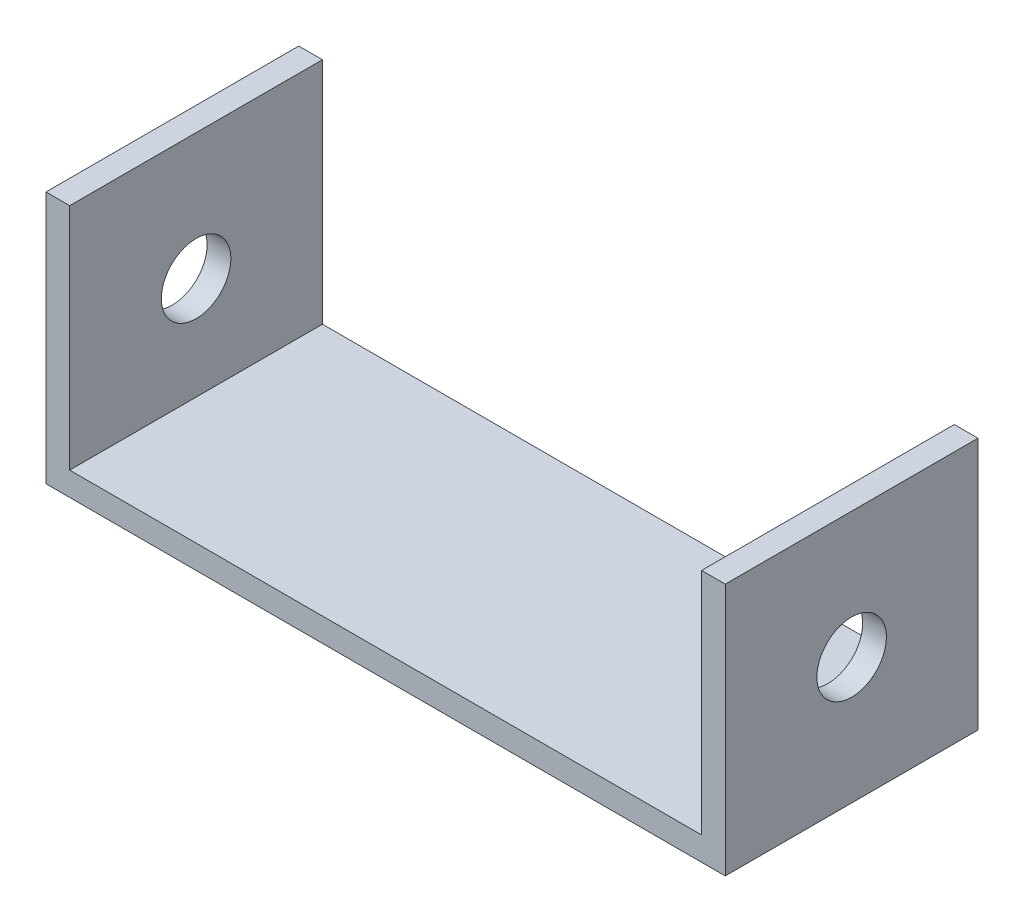
ISO-10303-21;
HEADER;
FILE_DESCRIPTION(('STEP AP214'),'2;1');
FILE_NAME('part.step','',(''),(''),'','','');
FILE_SCHEMA(('AUTOMOTIVE_DESIGN { 1 0 10303 214 1 1 1 1 }'));
ENDSEC;
DATA;
#1=APPLICATION_CONTEXT('core data for automotive mechanical design processes');
#2=APPLICATION_PROTOCOL_DEFINITION('international standard','automotive_design',2000,#1);
#3=PRODUCT_CONTEXT('',#1,'mechanical');
#4=PRODUCT('Part','Part','',(#3));
#5=PRODUCT_RELATED_PRODUCT_CATEGORY('part','',(#4));
#6=PRODUCT_DEFINITION_FORMATION('','',#4);
#7=PRODUCT_DEFINITION_CONTEXT('part definition',#1,'design');
#8=PRODUCT_DEFINITION('design','',#6,#7);
#9=PRODUCT_DEFINITION_SHAPE('','',#8);
#10=(LENGTH_UNIT() NAMED_UNIT(*) SI_UNIT(.MILLI.,.METRE.));
#11=(NAMED_UNIT(*) PLANE_ANGLE_UNIT() SI_UNIT($,.RADIAN.));
#12=(NAMED_UNIT(*) SI_UNIT($,.STERADIAN.) SOLID_ANGLE_UNIT());
#13=UNCERTAINTY_MEASURE_WITH_UNIT(LENGTH_MEASURE(1.E-05),#10,'distance_accuracy_value','');
#14=(GEOMETRIC_REPRESENTATION_CONTEXT(3) GLOBAL_UNCERTAINTY_ASSIGNED_CONTEXT((#13)) GLOBAL_UNIT_ASSIGNED_CONTEXT((#10,
#11,#12)) REPRESENTATION_CONTEXT('',''));
#15=CARTESIAN_POINT('',(0.,0.,0.));
#16=DIRECTION('',(0.,0.,1.));
#17=DIRECTION('',(1.,0.,0.));
#18=AXIS2_PLACEMENT_3D('',#15,#16,#17);
#19=CARTESIAN_POINT('',(-70.1343283582089,4.7625,19.334328358209));
#20=DIRECTION('',(0.,0.,-1.));
#21=DIRECTION('',(-1.,0.,0.));
#22=AXIS2_PLACEMENT_3D('',#19,#20,#21);
#23=PLANE('',#22);
#24=DIRECTION('',(1.,0.,0.));
#25=VECTOR('',#24,1.);
#26=CARTESIAN_POINT('',(-70.1343283582089,0.,19.334328358209));
#27=LINE('',#26,#25);
#28=CARTESIAN_POINT('',(-74.8968283582089,0.,19.334328358209));
#29=VERTEX_POINT('',#28);
#30=CARTESIAN_POINT('',(61.6281716417911,0.,19.334328358209));
#31=VERTEX_POINT('',#30);
#32=EDGE_CURVE('E296',#29,#31,#27,.T.);
#33=ORIENTED_EDGE('',*,*,#32,.T.);
#34=DIRECTION('',(0.,-1.,0.));
#35=VECTOR('',#34,1.);
#36=CARTESIAN_POINT('',(61.6281716417911,50.8,19.334328358209));
#37=LINE('',#36,#35);
#38=CARTESIAN_POINT('',(61.6281716417911,50.8,19.334328358209));
#39=VERTEX_POINT('',#38);
#40=EDGE_CURVE('E307',#39,#31,#37,.T.);
#41=ORIENTED_EDGE('',*,*,#40,.F.);
#42=DIRECTION('',(1.,0.,0.));
#43=VECTOR('',#42,1.);
#44=CARTESIAN_POINT('',(61.6281716417911,50.8,19.334328358209));
#45=LINE('',#44,#43);
#46=CARTESIAN_POINT('',(56.8656716417911,50.8,19.334328358209));
#47=VERTEX_POINT('',#46);
#48=EDGE_CURVE('E289',#47,#39,#45,.T.);
#49=ORIENTED_EDGE('',*,*,#48,.F.);
#50=DIRECTION('',(0.,-1.,0.));
#51=VECTOR('',#50,1.);
#52=CARTESIAN_POINT('',(56.8656716417911,50.8,19.334328358209));
#53=LINE('',#52,#51);
#54=CARTESIAN_POINT('',(56.8656716417911,4.7625,19.334328358209));
#55=VERTEX_POINT('',#54);
#56=EDGE_CURVE('E300',#47,#55,#53,.T.);
#57=ORIENTED_EDGE('',*,*,#56,.T.);
#58=DIRECTION('',(1.,0.,0.));
#59=VECTOR('',#58,1.);
#60=CARTESIAN_POINT('',(-70.1343283582089,4.7625,19.334328358209));
#61=LINE('',#60,#59);
#62=CARTESIAN_POINT('',(-70.1343283582089,4.7625,19.334328358209));
#63=VERTEX_POINT('',#62);
#64=EDGE_CURVE('E320',#63,#55,#61,.T.);
#65=ORIENTED_EDGE('',*,*,#64,.F.);
#66=DIRECTION('',(0.,-1.,0.));
#67=VECTOR('',#66,1.);
#68=CARTESIAN_POINT('',(-70.1343283582089,50.8,19.334328358209));
#69=LINE('',#68,#67);
#70=CARTESIAN_POINT('',(-70.1343283582089,50.8,19.334328358209));
#71=VERTEX_POINT('',#70);
#72=EDGE_CURVE('E58',#71,#63,#69,.T.);
#73=ORIENTED_EDGE('',*,*,#72,.F.);
#74=DIRECTION('',(1.,0.,0.));
#75=VECTOR('',#74,1.);
#76=CARTESIAN_POINT('',(-74.8968283582089,50.8,19.334328358209));
#77=LINE('',#76,#75);
#78=CARTESIAN_POINT('',(-74.8968283582089,50.8,19.334328358209));
#79=VERTEX_POINT('',#78);
#80=EDGE_CURVE('E101',#79,#71,#77,.T.);
#81=ORIENTED_EDGE('',*,*,#80,.F.);
#82=DIRECTION('',(0.,-1.,0.));
#83=VECTOR('',#82,1.);
#84=CARTESIAN_POINT('',(-74.8968283582089,50.8,19.334328358209));
#85=LINE('',#84,#83);
#86=EDGE_CURVE('E104',#79,#29,#85,.T.);
#87=ORIENTED_EDGE('',*,*,#86,.T.);
#88=EDGE_LOOP('',(#33,#41,#49,#57,#65,#73,#81,#87));
#89=FACE_BOUND('',#88,.T.);
#90=ADVANCED_FACE('F34',(#89),#23,.F.);
#91=CARTESIAN_POINT('',(-70.1343283582089,4.7625,-31.465671641791));
#92=DIRECTION('',(0.,0.,1.));
#93=DIRECTION('',(1.,0.,0.));
#94=AXIS2_PLACEMENT_3D('',#91,#92,#93);
#95=PLANE('',#94);
#96=DIRECTION('',(-1.,0.,0.));
#97=VECTOR('',#96,1.);
#98=CARTESIAN_POINT('',(-70.1343283582089,0.,-31.465671641791));
#99=LINE('',#98,#97);
#100=CARTESIAN_POINT('',(61.6281716417911,0.,-31.465671641791));
#101=VERTEX_POINT('',#100);
#102=CARTESIAN_POINT('',(-74.8968283582089,0.,-31.465671641791));
#103=VERTEX_POINT('',#102);
#104=EDGE_CURVE('E298',#101,#103,#99,.T.);
#105=ORIENTED_EDGE('',*,*,#104,.T.);
#106=DIRECTION('',(0.,-1.,0.));
#107=VECTOR('',#106,1.);
#108=CARTESIAN_POINT('',(-74.8968283582089,50.8,-31.465671641791));
#109=LINE('',#108,#107);
#110=CARTESIAN_POINT('',(-74.8968283582089,50.8,-31.465671641791));
#111=VERTEX_POINT('',#110);
#112=EDGE_CURVE('E133',#111,#103,#109,.T.);
#113=ORIENTED_EDGE('',*,*,#112,.F.);
#114=DIRECTION('',(-1.,0.,0.));
#115=VECTOR('',#114,1.);
#116=CARTESIAN_POINT('',(-74.8968283582089,50.8,-31.465671641791));
#117=LINE('',#116,#115);
#118=CARTESIAN_POINT('',(-70.1343283582089,50.8,-31.465671641791));
#119=VERTEX_POINT('',#118);
#120=EDGE_CURVE('E113',#119,#111,#117,.T.);
#121=ORIENTED_EDGE('',*,*,#120,.F.);
#122=DIRECTION('',(0.,-1.,0.));
#123=VECTOR('',#122,1.);
#124=CARTESIAN_POINT('',(-70.1343283582089,50.8,-31.465671641791));
#125=LINE('',#124,#123);
#126=CARTESIAN_POINT('',(-70.1343283582089,4.7625,-31.465671641791));
#127=VERTEX_POINT('',#126);
#128=EDGE_CURVE('E126',#119,#127,#125,.T.);
#129=ORIENTED_EDGE('',*,*,#128,.T.);
#130=DIRECTION('',(-1.,0.,0.));
#131=VECTOR('',#130,1.);
#132=CARTESIAN_POINT('',(-70.1343283582089,4.7625,-31.465671641791));
#133=LINE('',#132,#131);
#134=CARTESIAN_POINT('',(56.8656716417911,4.7625,-31.465671641791));
#135=VERTEX_POINT('',#134);
#136=EDGE_CURVE('E11',#135,#127,#133,.T.);
#137=ORIENTED_EDGE('',*,*,#136,.F.);
#138=DIRECTION('',(0.,-1.,0.));
#139=VECTOR('',#138,1.);
#140=CARTESIAN_POINT('',(56.8656716417911,50.8,-31.465671641791));
#141=LINE('',#140,#139);
#142=CARTESIAN_POINT('',(56.8656716417911,50.8,-31.465671641791));
#143=VERTEX_POINT('',#142);
#144=EDGE_CURVE('E50',#143,#135,#141,.T.);
#145=ORIENTED_EDGE('',*,*,#144,.F.);
#146=DIRECTION('',(-1.,0.,0.));
#147=VECTOR('',#146,1.);
#148=CARTESIAN_POINT('',(61.6281716417911,50.8,-31.465671641791));
#149=LINE('',#148,#147);
#150=CARTESIAN_POINT('',(61.6281716417911,50.8,-31.465671641791));
#151=VERTEX_POINT('',#150);
#152=EDGE_CURVE('E287',#151,#143,#149,.T.);
#153=ORIENTED_EDGE('',*,*,#152,.F.);
#154=DIRECTION('',(0.,-1.,0.));
#155=VECTOR('',#154,1.);
#156=CARTESIAN_POINT('',(61.6281716417911,50.8,-31.465671641791));
#157=LINE('',#156,#155);
#158=EDGE_CURVE('E294',#151,#101,#157,.T.);
#159=ORIENTED_EDGE('',*,*,#158,.T.);
#160=EDGE_LOOP('',(#105,#113,#121,#129,#137,#145,#153,#159));
#161=FACE_BOUND('',#160,.T.);
#162=ADVANCED_FACE('F168',(#161),#95,.F.);
#163=CARTESIAN_POINT('',(0.,4.7625,0.));
#164=DIRECTION('',(0.,1.,0.));
#165=DIRECTION('',(0.,0.,1.));
#166=AXIS2_PLACEMENT_3D('',#163,#164,#165);
#167=PLANE('',#166);
#168=DIRECTION('',(0.,0.,1.));
#169=VECTOR('',#168,1.);
#170=CARTESIAN_POINT('',(-70.1343283582089,4.7625,-31.465671641791));
#171=LINE('',#170,#169);
#172=EDGE_CURVE('E317',#127,#63,#171,.T.);
#173=ORIENTED_EDGE('',*,*,#172,.T.);
#174=ORIENTED_EDGE('',*,*,#64,.T.);
#175=DIRECTION('',(0.,0.,-1.));
#176=VECTOR('',#175,1.);
#177=CARTESIAN_POINT('',(56.8656716417911,4.7625,-31.465671641791));
#178=LINE('',#177,#176);
#179=EDGE_CURVE('E42',#55,#135,#178,.T.);
#180=ORIENTED_EDGE('',*,*,#179,.T.);
#181=ORIENTED_EDGE('',*,*,#136,.T.);
#182=EDGE_LOOP('',(#173,#174,#180,#181));
#183=FACE_BOUND('',#182,.T.);
#184=ADVANCED_FACE('F172',(#183),#167,.T.);
#185=CARTESIAN_POINT('',(0.,0.,0.));
#186=DIRECTION('',(0.,1.,0.));
#187=DIRECTION('',(0.,0.,1.));
#188=AXIS2_PLACEMENT_3D('',#185,#186,#187);
#189=PLANE('',#188);
#190=ORIENTED_EDGE('',*,*,#32,.F.);
#191=DIRECTION('',(0.,0.,1.));
#192=VECTOR('',#191,1.);
#193=CARTESIAN_POINT('',(-74.8968283582089,0.,-31.465671641791));
#194=LINE('',#193,#192);
#195=EDGE_CURVE('E117',#103,#29,#194,.T.);
#196=ORIENTED_EDGE('',*,*,#195,.F.);
#197=ORIENTED_EDGE('',*,*,#104,.F.);
#198=DIRECTION('',(0.,0.,-1.));
#199=VECTOR('',#198,1.);
#200=CARTESIAN_POINT('',(61.6281716417911,0.,-31.465671641791));
#201=LINE('',#200,#199);
#202=EDGE_CURVE('E121',#31,#101,#201,.T.);
#203=ORIENTED_EDGE('',*,*,#202,.F.);
#204=EDGE_LOOP('',(#190,#196,#197,#203));
#205=FACE_BOUND('',#204,.T.);
#206=ADVANCED_FACE('F177',(#205),#189,.F.);
#207=CARTESIAN_POINT('',(61.6281716417911,50.8,-31.465671641791));
#208=DIRECTION('',(-1.,0.,0.));
#209=DIRECTION('',(0.,0.,1.));
#210=AXIS2_PLACEMENT_3D('',#207,#208,#209);
#211=PLANE('',#210);
#212=CARTESIAN_POINT('',(61.6281716417911,25.4,-6.06567164179102));
#213=DIRECTION('',(-1.,0.,0.));
#214=DIRECTION('',(0.,0.,1.));
#215=AXIS2_PLACEMENT_3D('',#212,#213,#214);
#216=CIRCLE('',#215,6.985);
#217=CARTESIAN_POINT('',(61.6281716417911,25.4,0.919328358208984));
#218=VERTEX_POINT('',#217);
#219=EDGE_CURVE('E147',#218,#218,#216,.T.);
#220=ORIENTED_EDGE('',*,*,#219,.T.);
#221=EDGE_LOOP('',(#220));
#222=FACE_BOUND('',#221,.T.);
#223=ORIENTED_EDGE('',*,*,#202,.T.);
#224=ORIENTED_EDGE('',*,*,#158,.F.);
#225=DIRECTION('',(0.,0.,-1.));
#226=VECTOR('',#225,1.);
#227=CARTESIAN_POINT('',(61.6281716417911,50.8,-31.465671641791));
#228=LINE('',#227,#226);
#229=EDGE_CURVE('E124',#39,#151,#228,.T.);
#230=ORIENTED_EDGE('',*,*,#229,.F.);
#231=ORIENTED_EDGE('',*,*,#40,.T.);
#232=EDGE_LOOP('',(#223,#224,#230,#231));
#233=FACE_BOUND('',#232,.T.);
#234=ADVANCED_FACE('F182',(#222,#233),#211,.F.);
#235=CARTESIAN_POINT('',(56.8656716417911,50.8,-31.465671641791));
#236=DIRECTION('',(1.,0.,0.));
#237=DIRECTION('',(0.,0.,-1.));
#238=AXIS2_PLACEMENT_3D('',#235,#236,#237);
#239=PLANE('',#238);
#240=CARTESIAN_POINT('',(56.8656716417911,25.4,-6.06567164179102));
#241=DIRECTION('',(1.,0.,0.));
#242=DIRECTION('',(0.,0.,-1.));
#243=AXIS2_PLACEMENT_3D('',#240,#241,#242);
#244=CIRCLE('',#243,6.985);
#245=CARTESIAN_POINT('',(56.8656716417911,25.4,-13.050671641791));
#246=VERTEX_POINT('',#245);
#247=EDGE_CURVE('E139',#246,#246,#244,.T.);
#248=ORIENTED_EDGE('',*,*,#247,.T.);
#249=EDGE_LOOP('',(#248));
#250=FACE_BOUND('',#249,.T.);
#251=ORIENTED_EDGE('',*,*,#179,.F.);
#252=ORIENTED_EDGE('',*,*,#56,.F.);
#253=DIRECTION('',(0.,0.,1.));
#254=VECTOR('',#253,1.);
#255=CARTESIAN_POINT('',(56.8656716417911,50.8,-31.465671641791));
#256=LINE('',#255,#254);
#257=EDGE_CURVE('E313',#143,#47,#256,.T.);
#258=ORIENTED_EDGE('',*,*,#257,.F.);
#259=ORIENTED_EDGE('',*,*,#144,.T.);
#260=EDGE_LOOP('',(#251,#252,#258,#259));
#261=FACE_BOUND('',#260,.T.);
#262=ADVANCED_FACE('F187',(#250,#261),#239,.F.);
#263=CARTESIAN_POINT('',(0.,50.8,0.));
#264=DIRECTION('',(0.,-1.,0.));
#265=DIRECTION('',(0.,0.,-1.));
#266=AXIS2_PLACEMENT_3D('',#263,#264,#265);
#267=PLANE('',#266);
#268=ORIENTED_EDGE('',*,*,#229,.T.);
#269=ORIENTED_EDGE('',*,*,#152,.T.);
#270=ORIENTED_EDGE('',*,*,#257,.T.);
#271=ORIENTED_EDGE('',*,*,#48,.T.);
#272=EDGE_LOOP('',(#268,#269,#270,#271));
#273=FACE_BOUND('',#272,.T.);
#274=ADVANCED_FACE('F190',(#273),#267,.F.);
#275=CARTESIAN_POINT('',(-74.8968283582089,50.8,-31.465671641791));
#276=DIRECTION('',(1.,0.,0.));
#277=DIRECTION('',(0.,0.,-1.));
#278=AXIS2_PLACEMENT_3D('',#275,#276,#277);
#279=PLANE('',#278);
#280=CARTESIAN_POINT('',(-74.8968283582089,25.4,-6.06567164179102));
#281=DIRECTION('',(-1.,0.,0.));
#282=DIRECTION('',(0.,0.,1.));
#283=AXIS2_PLACEMENT_3D('',#280,#281,#282);
#284=CIRCLE('',#283,6.985);
#285=CARTESIAN_POINT('',(-74.8968283582089,25.4,0.919328358208984));
#286=VERTEX_POINT('',#285);
#287=EDGE_CURVE('E144',#286,#286,#284,.T.);
#288=ORIENTED_EDGE('',*,*,#287,.F.);
#289=EDGE_LOOP('',(#288));
#290=FACE_BOUND('',#289,.T.);
#291=ORIENTED_EDGE('',*,*,#195,.T.);
#292=ORIENTED_EDGE('',*,*,#86,.F.);
#293=DIRECTION('',(0.,0.,1.));
#294=VECTOR('',#293,1.);
#295=CARTESIAN_POINT('',(-74.8968283582089,50.8,-31.465671641791));
#296=LINE('',#295,#294);
#297=EDGE_CURVE('E108',#111,#79,#296,.T.);
#298=ORIENTED_EDGE('',*,*,#297,.F.);
#299=ORIENTED_EDGE('',*,*,#112,.T.);
#300=EDGE_LOOP('',(#291,#292,#298,#299));
#301=FACE_BOUND('',#300,.T.);
#302=ADVANCED_FACE('F119',(#290,#301),#279,.F.);
#303=CARTESIAN_POINT('',(-70.1343283582089,50.8,-31.465671641791));
#304=DIRECTION('',(-1.,0.,0.));
#305=DIRECTION('',(0.,0.,1.));
#306=AXIS2_PLACEMENT_3D('',#303,#304,#305);
#307=PLANE('',#306);
#308=CARTESIAN_POINT('',(-70.1343283582089,25.4,-6.06567164179102));
#309=DIRECTION('',(-1.,0.,0.));
#310=DIRECTION('',(0.,0.,1.));
#311=AXIS2_PLACEMENT_3D('',#308,#309,#310);
#312=CIRCLE('',#311,6.985);
#313=CARTESIAN_POINT('',(-70.1343283582089,25.4,0.919328358208984));
#314=VERTEX_POINT('',#313);
#315=EDGE_CURVE('E37',#314,#314,#312,.T.);
#316=ORIENTED_EDGE('',*,*,#315,.T.);
#317=EDGE_LOOP('',(#316));
#318=FACE_BOUND('',#317,.T.);
#319=ORIENTED_EDGE('',*,*,#172,.F.);
#320=ORIENTED_EDGE('',*,*,#128,.F.);
#321=DIRECTION('',(0.,0.,-1.));
#322=VECTOR('',#321,1.);
#323=CARTESIAN_POINT('',(-70.1343283582089,50.8,-31.465671641791));
#324=LINE('',#323,#322);
#325=EDGE_CURVE('E107',#71,#119,#324,.T.);
#326=ORIENTED_EDGE('',*,*,#325,.F.);
#327=ORIENTED_EDGE('',*,*,#72,.T.);
#328=EDGE_LOOP('',(#319,#320,#326,#327));
#329=FACE_BOUND('',#328,.T.);
#330=ADVANCED_FACE('F154',(#318,#329),#307,.F.);
#331=CARTESIAN_POINT('',(0.,50.8,0.));
#332=DIRECTION('',(0.,1.,0.));
#333=DIRECTION('',(0.,0.,1.));
#334=AXIS2_PLACEMENT_3D('',#331,#332,#333);
#335=PLANE('',#334);
#336=ORIENTED_EDGE('',*,*,#297,.T.);
#337=ORIENTED_EDGE('',*,*,#80,.T.);
#338=ORIENTED_EDGE('',*,*,#325,.T.);
#339=ORIENTED_EDGE('',*,*,#120,.T.);
#340=EDGE_LOOP('',(#336,#337,#338,#339));
#341=FACE_BOUND('',#340,.T.);
#342=ADVANCED_FACE('F111',(#341),#335,.T.);
#343=CARTESIAN_POINT('',(61.6281716417911,25.4,-6.06567164179102));
#344=DIRECTION('',(-1.,0.,0.));
#345=DIRECTION('',(0.,0.,1.));
#346=AXIS2_PLACEMENT_3D('',#343,#344,#345);
#347=CYLINDRICAL_SURFACE('',#346,6.985);
#348=ORIENTED_EDGE('',*,*,#287,.T.);
#349=EDGE_LOOP('',(#348));
#350=FACE_BOUND('',#349,.T.);
#351=ORIENTED_EDGE('',*,*,#315,.F.);
#352=EDGE_LOOP('',(#351));
#353=FACE_BOUND('',#352,.T.);
#354=ADVANCED_FACE('F156',(#350,#353),#347,.F.);
#355=ORIENTED_EDGE('',*,*,#219,.F.);
#356=EDGE_LOOP('',(#355));
#357=FACE_BOUND('',#356,.T.);
#358=ORIENTED_EDGE('',*,*,#247,.F.);
#359=EDGE_LOOP('',(#358));
#360=FACE_BOUND('',#359,.T.);
#361=ADVANCED_FACE('F158',(#357,#360),#347,.F.);
#362=CLOSED_SHELL('',(#90,#162,#184,#206,#234,#262,#274,#302,#330,#342,#354,#361));
#363=MANIFOLD_SOLID_BREP('B2',#362);
#364=ADVANCED_BREP_SHAPE_REPRESENTATION('',(#18,#363),#14);
#365=SHAPE_DEFINITION_REPRESENTATION(#9,#364);
ENDSEC;
END-ISO-10303-21;
